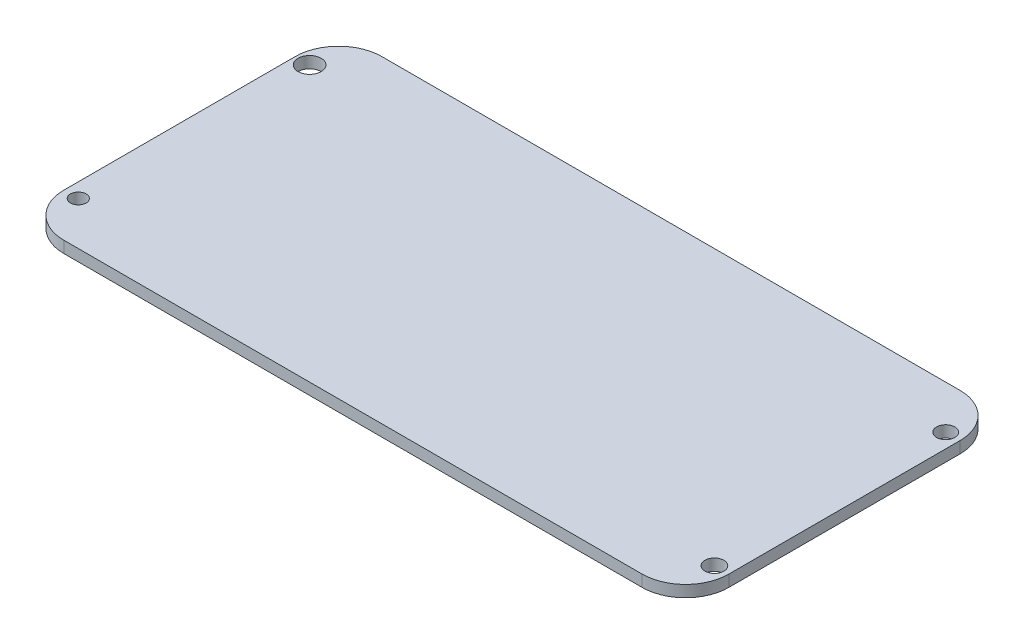
ISO-10303-21;
HEADER;
FILE_DESCRIPTION(('STEP AP214'),'2;1');
FILE_NAME('part.step','',(''),(''),'','','');
FILE_SCHEMA(('AUTOMOTIVE_DESIGN { 1 0 10303 214 1 1 1 1 }'));
ENDSEC;
DATA;
#1=APPLICATION_CONTEXT('core data for automotive mechanical design processes');
#2=APPLICATION_PROTOCOL_DEFINITION('international standard','automotive_design',2000,#1);
#3=PRODUCT_CONTEXT('',#1,'mechanical');
#4=PRODUCT('Part','Part','',(#3));
#5=PRODUCT_RELATED_PRODUCT_CATEGORY('part','',(#4));
#6=PRODUCT_DEFINITION_FORMATION('','',#4);
#7=PRODUCT_DEFINITION_CONTEXT('part definition',#1,'design');
#8=PRODUCT_DEFINITION('design','',#6,#7);
#9=PRODUCT_DEFINITION_SHAPE('','',#8);
#10=(LENGTH_UNIT() NAMED_UNIT(*) SI_UNIT(.MILLI.,.METRE.));
#11=(NAMED_UNIT(*) PLANE_ANGLE_UNIT() SI_UNIT($,.RADIAN.));
#12=(NAMED_UNIT(*) SI_UNIT($,.STERADIAN.) SOLID_ANGLE_UNIT());
#13=UNCERTAINTY_MEASURE_WITH_UNIT(LENGTH_MEASURE(1.E-05),#10,'distance_accuracy_value','');
#14=(GEOMETRIC_REPRESENTATION_CONTEXT(3) GLOBAL_UNCERTAINTY_ASSIGNED_CONTEXT((#13)) GLOBAL_UNIT_ASSIGNED_CONTEXT((#10,
#11,#12)) REPRESENTATION_CONTEXT('',''));
#15=CARTESIAN_POINT('',(0.,0.,0.));
#16=DIRECTION('',(0.,0.,1.));
#17=DIRECTION('',(1.,0.,0.));
#18=AXIS2_PLACEMENT_3D('',#15,#16,#17);
#19=CARTESIAN_POINT('',(0.,1.6,0.));
#20=DIRECTION('',(0.,-1.,0.));
#21=DIRECTION('',(0.,0.,-1.));
#22=AXIS2_PLACEMENT_3D('',#19,#20,#21);
#23=PLANE('',#22);
#24=DIRECTION('',(-1.,0.,0.));
#25=VECTOR('',#24,1.);
#26=CARTESIAN_POINT('',(0.,1.6,-44.));
#27=LINE('',#26,#25);
#28=CARTESIAN_POINT('',(86.,1.6,-44.));
#29=VERTEX_POINT('',#28);
#30=CARTESIAN_POINT('',(6.,1.6,-44.));
#31=VERTEX_POINT('',#30);
#32=EDGE_CURVE('E136',#29,#31,#27,.T.);
#33=ORIENTED_EDGE('',*,*,#32,.T.);
#34=CARTESIAN_POINT('',(6.,1.6,-38.));
#35=DIRECTION('',(0.,-1.,0.));
#36=DIRECTION('',(0.,0.,-1.));
#37=AXIS2_PLACEMENT_3D('',#34,#35,#36);
#38=CIRCLE('',#37,6.);
#39=CARTESIAN_POINT('',(0.,1.6,-38.));
#40=VERTEX_POINT('',#39);
#41=EDGE_CURVE('E155',#31,#40,#38,.F.);
#42=ORIENTED_EDGE('',*,*,#41,.T.);
#43=DIRECTION('',(0.,0.,1.));
#44=VECTOR('',#43,1.);
#45=CARTESIAN_POINT('',(0.,1.6,0.));
#46=LINE('',#45,#44);
#47=CARTESIAN_POINT('',(0.,1.6,-6.));
#48=VERTEX_POINT('',#47);
#49=EDGE_CURVE('E119',#40,#48,#46,.T.);
#50=ORIENTED_EDGE('',*,*,#49,.T.);
#51=CARTESIAN_POINT('',(6.,1.6,-6.));
#52=DIRECTION('',(0.,-1.,0.));
#53=DIRECTION('',(0.,0.,-1.));
#54=AXIS2_PLACEMENT_3D('',#51,#52,#53);
#55=CIRCLE('',#54,6.);
#56=CARTESIAN_POINT('',(6.,1.6,0.));
#57=VERTEX_POINT('',#56);
#58=EDGE_CURVE('E150',#48,#57,#55,.F.);
#59=ORIENTED_EDGE('',*,*,#58,.T.);
#60=DIRECTION('',(1.,0.,0.));
#61=VECTOR('',#60,1.);
#62=CARTESIAN_POINT('',(0.,1.6,0.));
#63=LINE('',#62,#61);
#64=CARTESIAN_POINT('',(86.,1.6,0.));
#65=VERTEX_POINT('',#64);
#66=EDGE_CURVE('E166',#57,#65,#63,.T.);
#67=ORIENTED_EDGE('',*,*,#66,.T.);
#68=CARTESIAN_POINT('',(86.,1.6,-6.));
#69=DIRECTION('',(0.,-1.,0.));
#70=DIRECTION('',(0.,0.,-1.));
#71=AXIS2_PLACEMENT_3D('',#68,#69,#70);
#72=CIRCLE('',#71,6.);
#73=CARTESIAN_POINT('',(92.,1.6,-6.));
#74=VERTEX_POINT('',#73);
#75=EDGE_CURVE('E55',#65,#74,#72,.F.);
#76=ORIENTED_EDGE('',*,*,#75,.T.);
#77=DIRECTION('',(0.,0.,-1.));
#78=VECTOR('',#77,1.);
#79=CARTESIAN_POINT('',(92.,1.6,0.));
#80=LINE('',#79,#78);
#81=CARTESIAN_POINT('',(92.,1.6,-38.));
#82=VERTEX_POINT('',#81);
#83=EDGE_CURVE('E174',#74,#82,#80,.T.);
#84=ORIENTED_EDGE('',*,*,#83,.T.);
#85=CARTESIAN_POINT('',(86.,1.6,-38.));
#86=DIRECTION('',(0.,-1.,0.));
#87=DIRECTION('',(0.,0.,-1.));
#88=AXIS2_PLACEMENT_3D('',#85,#86,#87);
#89=CIRCLE('',#88,6.);
#90=EDGE_CURVE('E153',#82,#29,#89,.F.);
#91=ORIENTED_EDGE('',*,*,#90,.T.);
#92=EDGE_LOOP('',(#33,#42,#50,#59,#67,#76,#84,#91));
#93=FACE_BOUND('',#92,.T.);
#94=CARTESIAN_POINT('',(2.,1.6,-6.));
#95=DIRECTION('',(0.,1.,0.));
#96=DIRECTION('',(0.,0.,1.));
#97=AXIS2_PLACEMENT_3D('',#94,#95,#96);
#98=CIRCLE('',#97,1.09039187349482);
#99=CARTESIAN_POINT('',(2.,1.6,-4.90960812650519));
#100=VERTEX_POINT('',#99);
#101=EDGE_CURVE('E127',#100,#100,#98,.T.);
#102=ORIENTED_EDGE('',*,*,#101,.F.);
#103=EDGE_LOOP('',(#102));
#104=FACE_BOUND('',#103,.T.);
#105=CARTESIAN_POINT('',(2.,1.6,-38.));
#106=DIRECTION('',(0.,1.,0.));
#107=DIRECTION('',(0.,0.,1.));
#108=AXIS2_PLACEMENT_3D('',#105,#106,#107);
#109=CIRCLE('',#108,1.6);
#110=CARTESIAN_POINT('',(2.,1.6,-36.4));
#111=VERTEX_POINT('',#110);
#112=EDGE_CURVE('E181',#111,#111,#109,.T.);
#113=ORIENTED_EDGE('',*,*,#112,.F.);
#114=EDGE_LOOP('',(#113));
#115=FACE_BOUND('',#114,.T.);
#116=CARTESIAN_POINT('',(90.,1.6,-38.));
#117=DIRECTION('',(0.,1.,0.));
#118=DIRECTION('',(0.,0.,1.));
#119=AXIS2_PLACEMENT_3D('',#116,#117,#118);
#120=CIRCLE('',#119,1.26453084013073);
#121=CARTESIAN_POINT('',(90.,1.6,-36.7354691598693));
#122=VERTEX_POINT('',#121);
#123=EDGE_CURVE('E186',#122,#122,#120,.T.);
#124=ORIENTED_EDGE('',*,*,#123,.F.);
#125=EDGE_LOOP('',(#124));
#126=FACE_BOUND('',#125,.T.);
#127=CARTESIAN_POINT('',(90.,1.6,-6.));
#128=DIRECTION('',(0.,1.,0.));
#129=DIRECTION('',(0.,0.,1.));
#130=AXIS2_PLACEMENT_3D('',#127,#128,#129);
#131=CIRCLE('',#130,1.30872688128722);
#132=CARTESIAN_POINT('',(90.,1.6,-4.69127311871278));
#133=VERTEX_POINT('',#132);
#134=EDGE_CURVE('E192',#133,#133,#131,.T.);
#135=ORIENTED_EDGE('',*,*,#134,.F.);
#136=EDGE_LOOP('',(#135));
#137=FACE_BOUND('',#136,.T.);
#138=ADVANCED_FACE('F33',(#93,#104,#115,#126,#137),#23,.F.);
#139=CARTESIAN_POINT('',(0.,0.,0.));
#140=DIRECTION('',(0.,-1.,0.));
#141=DIRECTION('',(0.,0.,-1.));
#142=AXIS2_PLACEMENT_3D('',#139,#140,#141);
#143=PLANE('',#142);
#144=CARTESIAN_POINT('',(90.,0.,-38.));
#145=DIRECTION('',(0.,1.,0.));
#146=DIRECTION('',(0.,0.,1.));
#147=AXIS2_PLACEMENT_3D('',#144,#145,#146);
#148=CIRCLE('',#147,1.26453084013073);
#149=CARTESIAN_POINT('',(90.,0.,-36.7354691598693));
#150=VERTEX_POINT('',#149);
#151=EDGE_CURVE('E189',#150,#150,#148,.T.);
#152=ORIENTED_EDGE('',*,*,#151,.T.);
#153=EDGE_LOOP('',(#152));
#154=FACE_BOUND('',#153,.T.);
#155=CARTESIAN_POINT('',(2.,0.,-6.));
#156=DIRECTION('',(0.,1.,0.));
#157=DIRECTION('',(0.,0.,1.));
#158=AXIS2_PLACEMENT_3D('',#155,#156,#157);
#159=CIRCLE('',#158,1.09039187349482);
#160=CARTESIAN_POINT('',(2.,0.,-4.90960812650519));
#161=VERTEX_POINT('',#160);
#162=EDGE_CURVE('E133',#161,#161,#159,.T.);
#163=ORIENTED_EDGE('',*,*,#162,.T.);
#164=EDGE_LOOP('',(#163));
#165=FACE_BOUND('',#164,.T.);
#166=DIRECTION('',(0.,0.,1.));
#167=VECTOR('',#166,1.);
#168=CARTESIAN_POINT('',(0.,0.,0.));
#169=LINE('',#168,#167);
#170=CARTESIAN_POINT('',(0.,0.,-38.));
#171=VERTEX_POINT('',#170);
#172=CARTESIAN_POINT('',(0.,0.,-6.));
#173=VERTEX_POINT('',#172);
#174=EDGE_CURVE('E116',#171,#173,#169,.T.);
#175=ORIENTED_EDGE('',*,*,#174,.F.);
#176=CARTESIAN_POINT('',(6.,0.,-38.));
#177=DIRECTION('',(0.,-1.,0.));
#178=DIRECTION('',(0.,0.,-1.));
#179=AXIS2_PLACEMENT_3D('',#176,#177,#178);
#180=CIRCLE('',#179,6.);
#181=CARTESIAN_POINT('',(6.,0.,-44.));
#182=VERTEX_POINT('',#181);
#183=EDGE_CURVE('E99',#171,#182,#180,.T.);
#184=ORIENTED_EDGE('',*,*,#183,.T.);
#185=DIRECTION('',(-1.,0.,0.));
#186=VECTOR('',#185,1.);
#187=CARTESIAN_POINT('',(0.,0.,-44.));
#188=LINE('',#187,#186);
#189=CARTESIAN_POINT('',(86.,0.,-44.));
#190=VERTEX_POINT('',#189);
#191=EDGE_CURVE('E140',#190,#182,#188,.T.);
#192=ORIENTED_EDGE('',*,*,#191,.F.);
#193=CARTESIAN_POINT('',(86.,0.,-38.));
#194=DIRECTION('',(0.,-1.,0.));
#195=DIRECTION('',(0.,0.,-1.));
#196=AXIS2_PLACEMENT_3D('',#193,#194,#195);
#197=CIRCLE('',#196,6.);
#198=CARTESIAN_POINT('',(92.,0.,-38.));
#199=VERTEX_POINT('',#198);
#200=EDGE_CURVE('E110',#190,#199,#197,.T.);
#201=ORIENTED_EDGE('',*,*,#200,.T.);
#202=DIRECTION('',(0.,0.,-1.));
#203=VECTOR('',#202,1.);
#204=CARTESIAN_POINT('',(92.,0.,0.));
#205=LINE('',#204,#203);
#206=CARTESIAN_POINT('',(92.,0.,-6.));
#207=VERTEX_POINT('',#206);
#208=EDGE_CURVE('E130',#207,#199,#205,.T.);
#209=ORIENTED_EDGE('',*,*,#208,.F.);
#210=CARTESIAN_POINT('',(86.,0.,-6.));
#211=DIRECTION('',(0.,-1.,0.));
#212=DIRECTION('',(0.,0.,-1.));
#213=AXIS2_PLACEMENT_3D('',#210,#211,#212);
#214=CIRCLE('',#213,6.);
#215=CARTESIAN_POINT('',(86.,0.,0.));
#216=VERTEX_POINT('',#215);
#217=EDGE_CURVE('E144',#207,#216,#214,.T.);
#218=ORIENTED_EDGE('',*,*,#217,.T.);
#219=DIRECTION('',(1.,0.,0.));
#220=VECTOR('',#219,1.);
#221=CARTESIAN_POINT('',(0.,0.,0.));
#222=LINE('',#221,#220);
#223=CARTESIAN_POINT('',(6.,0.,0.));
#224=VERTEX_POINT('',#223);
#225=EDGE_CURVE('E126',#224,#216,#222,.T.);
#226=ORIENTED_EDGE('',*,*,#225,.F.);
#227=CARTESIAN_POINT('',(6.,0.,-6.));
#228=DIRECTION('',(0.,-1.,0.));
#229=DIRECTION('',(0.,0.,-1.));
#230=AXIS2_PLACEMENT_3D('',#227,#228,#229);
#231=CIRCLE('',#230,6.);
#232=EDGE_CURVE('E120',#224,#173,#231,.T.);
#233=ORIENTED_EDGE('',*,*,#232,.T.);
#234=EDGE_LOOP('',(#175,#184,#192,#201,#209,#218,#226,#233));
#235=FACE_BOUND('',#234,.T.);
#236=CARTESIAN_POINT('',(2.,0.,-38.));
#237=DIRECTION('',(0.,1.,0.));
#238=DIRECTION('',(0.,0.,1.));
#239=AXIS2_PLACEMENT_3D('',#236,#237,#238);
#240=CIRCLE('',#239,1.6);
#241=CARTESIAN_POINT('',(2.,0.,-36.4));
#242=VERTEX_POINT('',#241);
#243=EDGE_CURVE('E183',#242,#242,#240,.T.);
#244=ORIENTED_EDGE('',*,*,#243,.T.);
#245=EDGE_LOOP('',(#244));
#246=FACE_BOUND('',#245,.T.);
#247=CARTESIAN_POINT('',(90.,0.,-6.));
#248=DIRECTION('',(0.,1.,0.));
#249=DIRECTION('',(0.,0.,1.));
#250=AXIS2_PLACEMENT_3D('',#247,#248,#249);
#251=CIRCLE('',#250,1.30872688128722);
#252=CARTESIAN_POINT('',(90.,0.,-4.69127311871278));
#253=VERTEX_POINT('',#252);
#254=EDGE_CURVE('E195',#253,#253,#251,.T.);
#255=ORIENTED_EDGE('',*,*,#254,.T.);
#256=EDGE_LOOP('',(#255));
#257=FACE_BOUND('',#256,.T.);
#258=ADVANCED_FACE('F123',(#154,#165,#235,#246,#257),#143,.T.);
#259=CARTESIAN_POINT('',(0.,1.6,0.));
#260=DIRECTION('',(1.,0.,0.));
#261=DIRECTION('',(0.,0.,-1.));
#262=AXIS2_PLACEMENT_3D('',#259,#260,#261);
#263=PLANE('',#262);
#264=ORIENTED_EDGE('',*,*,#49,.F.);
#265=DIRECTION('',(0.,-1.,0.));
#266=VECTOR('',#265,1.);
#267=CARTESIAN_POINT('',(0.,1.6,-38.));
#268=LINE('',#267,#266);
#269=EDGE_CURVE('E103',#40,#171,#268,.T.);
#270=ORIENTED_EDGE('',*,*,#269,.T.);
#271=ORIENTED_EDGE('',*,*,#174,.T.);
#272=DIRECTION('',(0.,-1.,0.));
#273=VECTOR('',#272,1.);
#274=CARTESIAN_POINT('',(0.,1.6,-6.));
#275=LINE('',#274,#273);
#276=EDGE_CURVE('E121',#173,#48,#275,.F.);
#277=ORIENTED_EDGE('',*,*,#276,.T.);
#278=EDGE_LOOP('',(#264,#270,#271,#277));
#279=FACE_BOUND('',#278,.T.);
#280=ADVANCED_FACE('F115',(#279),#263,.F.);
#281=CARTESIAN_POINT('',(0.,1.6,0.));
#282=DIRECTION('',(0.,0.,-1.));
#283=DIRECTION('',(-1.,0.,0.));
#284=AXIS2_PLACEMENT_3D('',#281,#282,#283);
#285=PLANE('',#284);
#286=ORIENTED_EDGE('',*,*,#225,.T.);
#287=DIRECTION('',(0.,-1.,0.));
#288=VECTOR('',#287,1.);
#289=CARTESIAN_POINT('',(86.,1.6,0.));
#290=LINE('',#289,#288);
#291=EDGE_CURVE('E11',#216,#65,#290,.F.);
#292=ORIENTED_EDGE('',*,*,#291,.T.);
#293=ORIENTED_EDGE('',*,*,#66,.F.);
#294=DIRECTION('',(0.,-1.,0.));
#295=VECTOR('',#294,1.);
#296=CARTESIAN_POINT('',(6.,1.6,0.));
#297=LINE('',#296,#295);
#298=EDGE_CURVE('E41',#57,#224,#297,.T.);
#299=ORIENTED_EDGE('',*,*,#298,.T.);
#300=EDGE_LOOP('',(#286,#292,#293,#299));
#301=FACE_BOUND('',#300,.T.);
#302=ADVANCED_FACE('F164',(#301),#285,.F.);
#303=CARTESIAN_POINT('',(92.,1.6,0.));
#304=DIRECTION('',(-1.,0.,0.));
#305=DIRECTION('',(0.,0.,1.));
#306=AXIS2_PLACEMENT_3D('',#303,#304,#305);
#307=PLANE('',#306);
#308=ORIENTED_EDGE('',*,*,#208,.T.);
#309=DIRECTION('',(0.,-1.,0.));
#310=VECTOR('',#309,1.);
#311=CARTESIAN_POINT('',(92.,1.6,-38.));
#312=LINE('',#311,#310);
#313=EDGE_CURVE('E48',#199,#82,#312,.F.);
#314=ORIENTED_EDGE('',*,*,#313,.T.);
#315=ORIENTED_EDGE('',*,*,#83,.F.);
#316=DIRECTION('',(0.,-1.,0.));
#317=VECTOR('',#316,1.);
#318=CARTESIAN_POINT('',(92.,1.6,-6.));
#319=LINE('',#318,#317);
#320=EDGE_CURVE('E157',#74,#207,#319,.T.);
#321=ORIENTED_EDGE('',*,*,#320,.T.);
#322=EDGE_LOOP('',(#308,#314,#315,#321));
#323=FACE_BOUND('',#322,.T.);
#324=ADVANCED_FACE('F173',(#323),#307,.F.);
#325=CARTESIAN_POINT('',(0.,1.6,-44.));
#326=DIRECTION('',(0.,0.,1.));
#327=DIRECTION('',(1.,0.,0.));
#328=AXIS2_PLACEMENT_3D('',#325,#326,#327);
#329=PLANE('',#328);
#330=ORIENTED_EDGE('',*,*,#191,.T.);
#331=DIRECTION('',(0.,-1.,0.));
#332=VECTOR('',#331,1.);
#333=CARTESIAN_POINT('',(6.,1.6,-44.));
#334=LINE('',#333,#332);
#335=EDGE_CURVE('E104',#182,#31,#334,.F.);
#336=ORIENTED_EDGE('',*,*,#335,.T.);
#337=ORIENTED_EDGE('',*,*,#32,.F.);
#338=DIRECTION('',(0.,-1.,0.));
#339=VECTOR('',#338,1.);
#340=CARTESIAN_POINT('',(86.,1.6,-44.));
#341=LINE('',#340,#339);
#342=EDGE_CURVE('E109',#29,#190,#341,.T.);
#343=ORIENTED_EDGE('',*,*,#342,.T.);
#344=EDGE_LOOP('',(#330,#336,#337,#343));
#345=FACE_BOUND('',#344,.T.);
#346=ADVANCED_FACE('F216',(#345),#329,.F.);
#347=CARTESIAN_POINT('',(2.,1.6,-6.));
#348=DIRECTION('',(0.,-1.,0.));
#349=DIRECTION('',(0.,0.,-1.));
#350=AXIS2_PLACEMENT_3D('',#347,#348,#349);
#351=CYLINDRICAL_SURFACE('',#350,1.09039187349482);
#352=ORIENTED_EDGE('',*,*,#101,.T.);
#353=EDGE_LOOP('',(#352));
#354=FACE_BOUND('',#353,.T.);
#355=ORIENTED_EDGE('',*,*,#162,.F.);
#356=EDGE_LOOP('',(#355));
#357=FACE_BOUND('',#356,.T.);
#358=ADVANCED_FACE('F213',(#354,#357),#351,.F.);
#359=CARTESIAN_POINT('',(2.,1.6,-38.));
#360=DIRECTION('',(0.,-1.,0.));
#361=DIRECTION('',(0.,0.,-1.));
#362=AXIS2_PLACEMENT_3D('',#359,#360,#361);
#363=CYLINDRICAL_SURFACE('',#362,1.6);
#364=ORIENTED_EDGE('',*,*,#112,.T.);
#365=EDGE_LOOP('',(#364));
#366=FACE_BOUND('',#365,.T.);
#367=ORIENTED_EDGE('',*,*,#243,.F.);
#368=EDGE_LOOP('',(#367));
#369=FACE_BOUND('',#368,.T.);
#370=ADVANCED_FACE('F309',(#366,#369),#363,.F.);
#371=CARTESIAN_POINT('',(90.,1.6,-38.));
#372=DIRECTION('',(0.,-1.,0.));
#373=DIRECTION('',(0.,0.,-1.));
#374=AXIS2_PLACEMENT_3D('',#371,#372,#373);
#375=CYLINDRICAL_SURFACE('',#374,1.26453084013073);
#376=ORIENTED_EDGE('',*,*,#123,.T.);
#377=EDGE_LOOP('',(#376));
#378=FACE_BOUND('',#377,.T.);
#379=ORIENTED_EDGE('',*,*,#151,.F.);
#380=EDGE_LOOP('',(#379));
#381=FACE_BOUND('',#380,.T.);
#382=ADVANCED_FACE('F300',(#378,#381),#375,.F.);
#383=CARTESIAN_POINT('',(90.,1.6,-6.));
#384=DIRECTION('',(0.,-1.,0.));
#385=DIRECTION('',(0.,0.,-1.));
#386=AXIS2_PLACEMENT_3D('',#383,#384,#385);
#387=CYLINDRICAL_SURFACE('',#386,1.30872688128722);
#388=ORIENTED_EDGE('',*,*,#134,.T.);
#389=EDGE_LOOP('',(#388));
#390=FACE_BOUND('',#389,.T.);
#391=ORIENTED_EDGE('',*,*,#254,.F.);
#392=EDGE_LOOP('',(#391));
#393=FACE_BOUND('',#392,.T.);
#394=ADVANCED_FACE('F201',(#390,#393),#387,.F.);
#395=CARTESIAN_POINT('',(6.,1.6,-38.));
#396=DIRECTION('',(0.,-1.,0.));
#397=DIRECTION('',(0.,0.,-1.));
#398=AXIS2_PLACEMENT_3D('',#395,#396,#397);
#399=CYLINDRICAL_SURFACE('',#398,6.);
#400=ORIENTED_EDGE('',*,*,#41,.F.);
#401=ORIENTED_EDGE('',*,*,#335,.F.);
#402=ORIENTED_EDGE('',*,*,#183,.F.);
#403=ORIENTED_EDGE('',*,*,#269,.F.);
#404=EDGE_LOOP('',(#400,#401,#402,#403));
#405=FACE_BOUND('',#404,.T.);
#406=ADVANCED_FACE('F102',(#405),#399,.T.);
#407=CARTESIAN_POINT('',(86.,1.6,-38.));
#408=DIRECTION('',(0.,-1.,0.));
#409=DIRECTION('',(0.,0.,-1.));
#410=AXIS2_PLACEMENT_3D('',#407,#408,#409);
#411=CYLINDRICAL_SURFACE('',#410,6.);
#412=ORIENTED_EDGE('',*,*,#90,.F.);
#413=ORIENTED_EDGE('',*,*,#313,.F.);
#414=ORIENTED_EDGE('',*,*,#200,.F.);
#415=ORIENTED_EDGE('',*,*,#342,.F.);
#416=EDGE_LOOP('',(#412,#413,#414,#415));
#417=FACE_BOUND('',#416,.T.);
#418=ADVANCED_FACE('F228',(#417),#411,.T.);
#419=CARTESIAN_POINT('',(86.,1.6,-6.));
#420=DIRECTION('',(0.,-1.,0.));
#421=DIRECTION('',(0.,0.,-1.));
#422=AXIS2_PLACEMENT_3D('',#419,#420,#421);
#423=CYLINDRICAL_SURFACE('',#422,6.);
#424=ORIENTED_EDGE('',*,*,#75,.F.);
#425=ORIENTED_EDGE('',*,*,#291,.F.);
#426=ORIENTED_EDGE('',*,*,#217,.F.);
#427=ORIENTED_EDGE('',*,*,#320,.F.);
#428=EDGE_LOOP('',(#424,#425,#426,#427));
#429=FACE_BOUND('',#428,.T.);
#430=ADVANCED_FACE('F172',(#429),#423,.T.);
#431=CARTESIAN_POINT('',(6.,1.6,-6.));
#432=DIRECTION('',(0.,-1.,0.));
#433=DIRECTION('',(0.,0.,-1.));
#434=AXIS2_PLACEMENT_3D('',#431,#432,#433);
#435=CYLINDRICAL_SURFACE('',#434,6.);
#436=ORIENTED_EDGE('',*,*,#58,.F.);
#437=ORIENTED_EDGE('',*,*,#276,.F.);
#438=ORIENTED_EDGE('',*,*,#232,.F.);
#439=ORIENTED_EDGE('',*,*,#298,.F.);
#440=EDGE_LOOP('',(#436,#437,#438,#439));
#441=FACE_BOUND('',#440,.T.);
#442=ADVANCED_FACE('F35',(#441),#435,.T.);
#443=CLOSED_SHELL('',(#138,#258,#280,#302,#324,#346,#358,#370,#382,#394,#406,#418,#430,#442));
#444=MANIFOLD_SOLID_BREP('B2',#443);
#445=ADVANCED_BREP_SHAPE_REPRESENTATION('',(#18,#444),#14);
#446=SHAPE_DEFINITION_REPRESENTATION(#9,#445);
ENDSEC;
END-ISO-10303-21;
